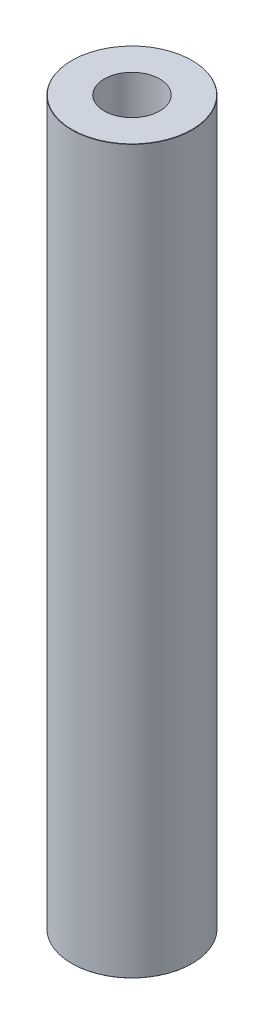
ISO-10303-21;
HEADER;
FILE_DESCRIPTION(('STEP AP214'),'2;1');
FILE_NAME('part.step','',(''),(''),'','','');
FILE_SCHEMA(('AUTOMOTIVE_DESIGN { 1 0 10303 214 1 1 1 1 }'));
ENDSEC;
DATA;
#1=APPLICATION_CONTEXT('core data for automotive mechanical design processes');
#2=APPLICATION_PROTOCOL_DEFINITION('international standard','automotive_design',2000,#1);
#3=PRODUCT_CONTEXT('',#1,'mechanical');
#4=PRODUCT('Part','Part','',(#3));
#5=PRODUCT_RELATED_PRODUCT_CATEGORY('part','',(#4));
#6=PRODUCT_DEFINITION_FORMATION('','',#4);
#7=PRODUCT_DEFINITION_CONTEXT('part definition',#1,'design');
#8=PRODUCT_DEFINITION('design','',#6,#7);
#9=PRODUCT_DEFINITION_SHAPE('','',#8);
#10=(LENGTH_UNIT() NAMED_UNIT(*) SI_UNIT(.MILLI.,.METRE.));
#11=(NAMED_UNIT(*) PLANE_ANGLE_UNIT() SI_UNIT($,.RADIAN.));
#12=(NAMED_UNIT(*) SI_UNIT($,.STERADIAN.) SOLID_ANGLE_UNIT());
#13=UNCERTAINTY_MEASURE_WITH_UNIT(LENGTH_MEASURE(1.E-05),#10,'distance_accuracy_value','');
#14=(GEOMETRIC_REPRESENTATION_CONTEXT(3) GLOBAL_UNCERTAINTY_ASSIGNED_CONTEXT((#13)) GLOBAL_UNIT_ASSIGNED_CONTEXT((#10,
#11,#12)) REPRESENTATION_CONTEXT('',''));
#15=CARTESIAN_POINT('',(0.,0.,0.));
#16=DIRECTION('',(0.,0.,1.));
#17=DIRECTION('',(1.,0.,0.));
#18=AXIS2_PLACEMENT_3D('',#15,#16,#17);
#19=CARTESIAN_POINT('',(0.,600.,0.));
#20=DIRECTION('',(0.,-1.,0.));
#21=DIRECTION('',(0.,0.,-1.));
#22=AXIS2_PLACEMENT_3D('',#19,#20,#21);
#23=CYLINDRICAL_SURFACE('',#22,50.);
#24=CARTESIAN_POINT('',(0.,599.797645549756,0.));
#25=DIRECTION('',(0.,1.,0.));
#26=DIRECTION('',(0.,0.,1.));
#27=AXIS2_PLACEMENT_3D('',#24,#25,#26);
#28=CIRCLE('',#27,50.);
#29=CARTESIAN_POINT('',(0.,599.797645549756,50.));
#30=VERTEX_POINT('',#29);
#31=EDGE_CURVE('E50',#30,#30,#28,.F.);
#32=ORIENTED_EDGE('',*,*,#31,.T.);
#33=EDGE_LOOP('',(#32));
#34=FACE_BOUND('',#33,.T.);
#35=CARTESIAN_POINT('',(0.,0.202354450244413,0.));
#36=DIRECTION('',(0.,1.,0.));
#37=DIRECTION('',(0.,0.,1.));
#38=AXIS2_PLACEMENT_3D('',#35,#36,#37);
#39=CIRCLE('',#38,50.);
#40=CARTESIAN_POINT('',(0.,0.202354450244413,50.));
#41=VERTEX_POINT('',#40);
#42=EDGE_CURVE('E51',#41,#41,#39,.T.);
#43=ORIENTED_EDGE('',*,*,#42,.T.);
#44=EDGE_LOOP('',(#43));
#45=FACE_BOUND('',#44,.T.);
#46=ADVANCED_FACE('F39',(#34,#45),#23,.T.);
#47=CARTESIAN_POINT('',(0.,600.,0.));
#48=DIRECTION('',(0.,1.,0.));
#49=DIRECTION('',(0.,0.,1.));
#50=AXIS2_PLACEMENT_3D('',#47,#48,#49);
#51=PLANE('',#50);
#52=CARTESIAN_POINT('',(0.,600.,0.));
#53=DIRECTION('',(0.,1.,0.));
#54=DIRECTION('',(0.,0.,1.));
#55=AXIS2_PLACEMENT_3D('',#52,#53,#54);
#56=CIRCLE('',#55,49.7976455497557);
#57=CARTESIAN_POINT('',(0.,600.,49.7976455497557));
#58=VERTEX_POINT('',#57);
#59=EDGE_CURVE('E54',#58,#58,#56,.T.);
#60=ORIENTED_EDGE('',*,*,#59,.T.);
#61=EDGE_LOOP('',(#60));
#62=FACE_BOUND('',#61,.T.);
#63=CARTESIAN_POINT('',(0.,600.,0.));
#64=DIRECTION('',(0.,1.,0.));
#65=DIRECTION('',(0.,0.,1.));
#66=AXIS2_PLACEMENT_3D('',#63,#64,#65);
#67=CIRCLE('',#66,23.0673563874883);
#68=CARTESIAN_POINT('',(0.,600.,23.0673563874883));
#69=VERTEX_POINT('',#68);
#70=EDGE_CURVE('E58',#69,#69,#67,.T.);
#71=ORIENTED_EDGE('',*,*,#70,.F.);
#72=EDGE_LOOP('',(#71));
#73=FACE_BOUND('',#72,.T.);
#74=ADVANCED_FACE('F69',(#62,#73),#51,.T.);
#75=CARTESIAN_POINT('',(0.,0.,0.));
#76=DIRECTION('',(0.,1.,0.));
#77=DIRECTION('',(0.,0.,1.));
#78=AXIS2_PLACEMENT_3D('',#75,#76,#77);
#79=PLANE('',#78);
#80=CARTESIAN_POINT('',(0.,0.,0.));
#81=DIRECTION('',(0.,1.,0.));
#82=DIRECTION('',(0.,0.,1.));
#83=AXIS2_PLACEMENT_3D('',#80,#81,#82);
#84=CIRCLE('',#83,49.7976455497556);
#85=CARTESIAN_POINT('',(0.,0.,49.7976455497556));
#86=VERTEX_POINT('',#85);
#87=EDGE_CURVE('E10',#86,#86,#84,.F.);
#88=ORIENTED_EDGE('',*,*,#87,.T.);
#89=EDGE_LOOP('',(#88));
#90=FACE_BOUND('',#89,.T.);
#91=CARTESIAN_POINT('',(0.,0.,0.));
#92=DIRECTION('',(0.,1.,0.));
#93=DIRECTION('',(0.,0.,1.));
#94=AXIS2_PLACEMENT_3D('',#91,#92,#93);
#95=CIRCLE('',#94,23.0673563874883);
#96=CARTESIAN_POINT('',(0.,0.,23.0673563874883));
#97=VERTEX_POINT('',#96);
#98=EDGE_CURVE('E63',#97,#97,#95,.T.);
#99=ORIENTED_EDGE('',*,*,#98,.T.);
#100=EDGE_LOOP('',(#99));
#101=FACE_BOUND('',#100,.T.);
#102=ADVANCED_FACE('F75',(#90,#101),#79,.F.);
#103=CARTESIAN_POINT('',(0.,600.,0.));
#104=DIRECTION('',(0.,-1.,0.));
#105=DIRECTION('',(0.,0.,-1.));
#106=AXIS2_PLACEMENT_3D('',#103,#104,#105);
#107=CYLINDRICAL_SURFACE('',#106,23.0673563874883);
#108=ORIENTED_EDGE('',*,*,#70,.T.);
#109=EDGE_LOOP('',(#108));
#110=FACE_BOUND('',#109,.T.);
#111=ORIENTED_EDGE('',*,*,#98,.F.);
#112=EDGE_LOOP('',(#111));
#113=FACE_BOUND('',#112,.T.);
#114=ADVANCED_FACE('F70',(#110,#113),#107,.F.);
#115=CARTESIAN_POINT('',(0.,600.,0.));
#116=DIRECTION('',(0.,-1.,0.));
#117=DIRECTION('',(0.,0.,-1.));
#118=AXIS2_PLACEMENT_3D('',#115,#116,#117);
#119=CONICAL_SURFACE('',#118,49.7976455497557,0.785398163397208);
#120=ORIENTED_EDGE('',*,*,#31,.F.);
#121=EDGE_LOOP('',(#120));
#122=FACE_BOUND('',#121,.T.);
#123=ORIENTED_EDGE('',*,*,#59,.F.);
#124=EDGE_LOOP('',(#123));
#125=FACE_BOUND('',#124,.T.);
#126=ADVANCED_FACE('F81',(#122,#125),#119,.T.);
#127=CARTESIAN_POINT('',(0.,0.202354450244413,0.));
#128=DIRECTION('',(0.,1.,0.));
#129=DIRECTION('',(0.,0.,1.));
#130=AXIS2_PLACEMENT_3D('',#127,#128,#129);
#131=CONICAL_SURFACE('',#130,50.,0.785398163397328);
#132=ORIENTED_EDGE('',*,*,#87,.F.);
#133=EDGE_LOOP('',(#132));
#134=FACE_BOUND('',#133,.T.);
#135=ORIENTED_EDGE('',*,*,#42,.F.);
#136=EDGE_LOOP('',(#135));
#137=FACE_BOUND('',#136,.T.);
#138=ADVANCED_FACE('F45',(#134,#137),#131,.T.);
#139=CLOSED_SHELL('',(#46,#74,#102,#114,#126,#138));
#140=MANIFOLD_SOLID_BREP('B2',#139);
#141=ADVANCED_BREP_SHAPE_REPRESENTATION('',(#18,#140),#14);
#142=SHAPE_DEFINITION_REPRESENTATION(#9,#141);
ENDSEC;
END-ISO-10303-21;
